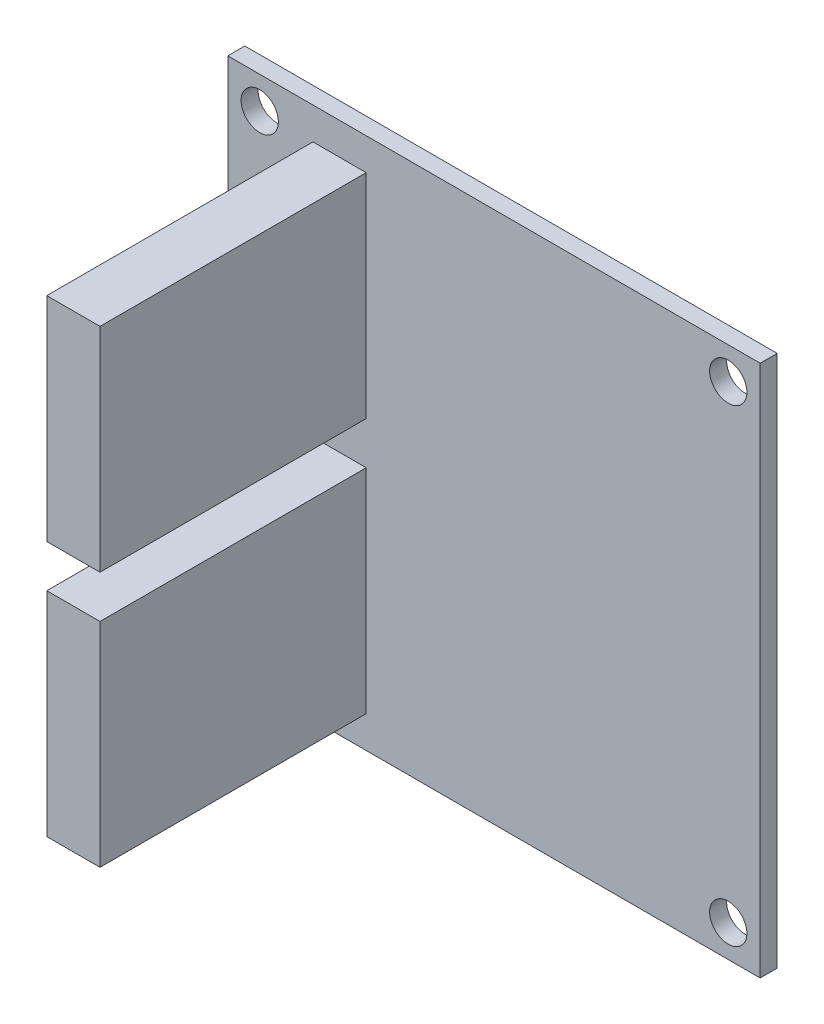
ISO-10303-21;
HEADER;
FILE_DESCRIPTION(('STEP AP214'),'2;1');
FILE_NAME('part.step','',(''),(''),'','','');
FILE_SCHEMA(('AUTOMOTIVE_DESIGN { 1 0 10303 214 1 1 1 1 }'));
ENDSEC;
DATA;
#1=APPLICATION_CONTEXT('core data for automotive mechanical design processes');
#2=APPLICATION_PROTOCOL_DEFINITION('international standard','automotive_design',2000,#1);
#3=PRODUCT_CONTEXT('',#1,'mechanical');
#4=PRODUCT('Part','Part','',(#3));
#5=PRODUCT_RELATED_PRODUCT_CATEGORY('part','',(#4));
#6=PRODUCT_DEFINITION_FORMATION('','',#4);
#7=PRODUCT_DEFINITION_CONTEXT('part definition',#1,'design');
#8=PRODUCT_DEFINITION('design','',#6,#7);
#9=PRODUCT_DEFINITION_SHAPE('','',#8);
#10=(LENGTH_UNIT() NAMED_UNIT(*) SI_UNIT(.MILLI.,.METRE.));
#11=(NAMED_UNIT(*) PLANE_ANGLE_UNIT() SI_UNIT($,.RADIAN.));
#12=(NAMED_UNIT(*) SI_UNIT($,.STERADIAN.) SOLID_ANGLE_UNIT());
#13=UNCERTAINTY_MEASURE_WITH_UNIT(LENGTH_MEASURE(1.E-05),#10,'distance_accuracy_value','');
#14=(GEOMETRIC_REPRESENTATION_CONTEXT(3) GLOBAL_UNCERTAINTY_ASSIGNED_CONTEXT((#13)) GLOBAL_UNIT_ASSIGNED_CONTEXT((#10,
#11,#12)) REPRESENTATION_CONTEXT('',''));
#15=CARTESIAN_POINT('',(0.,0.,0.));
#16=DIRECTION('',(0.,0.,1.));
#17=DIRECTION('',(1.,0.,0.));
#18=AXIS2_PLACEMENT_3D('',#15,#16,#17);
#19=CARTESIAN_POINT('',(0.,0.,1.6));
#20=DIRECTION('',(0.,0.,-1.));
#21=DIRECTION('',(-1.,0.,0.));
#22=AXIS2_PLACEMENT_3D('',#19,#20,#21);
#23=PLANE('',#22);
#24=DIRECTION('',(0.,-1.,0.));
#25=VECTOR('',#24,1.);
#26=CARTESIAN_POINT('',(8.,47.,1.6));
#27=LINE('',#26,#25);
#28=CARTESIAN_POINT('',(8.,47.,1.6));
#29=VERTEX_POINT('',#28);
#30=CARTESIAN_POINT('',(8.,27.,1.6));
#31=VERTEX_POINT('',#30);
#32=EDGE_CURVE('E142',#29,#31,#27,.T.);
#33=ORIENTED_EDGE('',*,*,#32,.F.);
#34=DIRECTION('',(-1.,0.,0.));
#35=VECTOR('',#34,1.);
#36=CARTESIAN_POINT('',(8.,47.,1.6));
#37=LINE('',#36,#35);
#38=CARTESIAN_POINT('',(13.,47.,1.6));
#39=VERTEX_POINT('',#38);
#40=EDGE_CURVE('E155',#39,#29,#37,.T.);
#41=ORIENTED_EDGE('',*,*,#40,.F.);
#42=DIRECTION('',(0.,1.,0.));
#43=VECTOR('',#42,1.);
#44=CARTESIAN_POINT('',(13.,47.,1.6));
#45=LINE('',#44,#43);
#46=CARTESIAN_POINT('',(13.,27.,1.6));
#47=VERTEX_POINT('',#46);
#48=EDGE_CURVE('E164',#47,#39,#45,.T.);
#49=ORIENTED_EDGE('',*,*,#48,.F.);
#50=DIRECTION('',(1.,0.,0.));
#51=VECTOR('',#50,1.);
#52=CARTESIAN_POINT('',(8.,27.,1.6));
#53=LINE('',#52,#51);
#54=EDGE_CURVE('E145',#31,#47,#53,.T.);
#55=ORIENTED_EDGE('',*,*,#54,.F.);
#56=EDGE_LOOP('',(#33,#41,#49,#55));
#57=FACE_BOUND('',#56,.T.);
#58=CARTESIAN_POINT('',(47.,3.,1.6));
#59=DIRECTION('',(0.,0.,-1.));
#60=DIRECTION('',(-1.,0.,0.));
#61=AXIS2_PLACEMENT_3D('',#58,#59,#60);
#62=CIRCLE('',#61,1.75);
#63=CARTESIAN_POINT('',(45.25,3.,1.6));
#64=VERTEX_POINT('',#63);
#65=EDGE_CURVE('E195',#64,#64,#62,.T.);
#66=ORIENTED_EDGE('',*,*,#65,.T.);
#67=EDGE_LOOP('',(#66));
#68=FACE_BOUND('',#67,.T.);
#69=CARTESIAN_POINT('',(47.,47.,1.6));
#70=DIRECTION('',(0.,0.,-1.));
#71=DIRECTION('',(-1.,0.,0.));
#72=AXIS2_PLACEMENT_3D('',#69,#70,#71);
#73=CIRCLE('',#72,1.75);
#74=CARTESIAN_POINT('',(45.25,47.,1.6));
#75=VERTEX_POINT('',#74);
#76=EDGE_CURVE('E192',#75,#75,#73,.T.);
#77=ORIENTED_EDGE('',*,*,#76,.T.);
#78=EDGE_LOOP('',(#77));
#79=FACE_BOUND('',#78,.T.);
#80=CARTESIAN_POINT('',(3.,47.,1.6));
#81=DIRECTION('',(0.,0.,-1.));
#82=DIRECTION('',(-1.,0.,0.));
#83=AXIS2_PLACEMENT_3D('',#80,#81,#82);
#84=CIRCLE('',#83,1.75);
#85=CARTESIAN_POINT('',(1.25,47.,1.6));
#86=VERTEX_POINT('',#85);
#87=EDGE_CURVE('E184',#86,#86,#84,.T.);
#88=ORIENTED_EDGE('',*,*,#87,.T.);
#89=EDGE_LOOP('',(#88));
#90=FACE_BOUND('',#89,.T.);
#91=CARTESIAN_POINT('',(3.00000000000001,3.,1.6));
#92=DIRECTION('',(0.,0.,-1.));
#93=DIRECTION('',(-1.,0.,0.));
#94=AXIS2_PLACEMENT_3D('',#91,#92,#93);
#95=CIRCLE('',#94,1.75);
#96=CARTESIAN_POINT('',(1.25000000000001,3.,1.6));
#97=VERTEX_POINT('',#96);
#98=EDGE_CURVE('E201',#97,#97,#95,.T.);
#99=ORIENTED_EDGE('',*,*,#98,.T.);
#100=EDGE_LOOP('',(#99));
#101=FACE_BOUND('',#100,.T.);
#102=DIRECTION('',(0.,-1.,0.));
#103=VECTOR('',#102,1.);
#104=CARTESIAN_POINT('',(0.,0.,1.6));
#105=LINE('',#104,#103);
#106=CARTESIAN_POINT('',(0.,50.,1.6));
#107=VERTEX_POINT('',#106);
#108=CARTESIAN_POINT('',(0.,0.,1.6));
#109=VERTEX_POINT('',#108);
#110=EDGE_CURVE('E205',#107,#109,#105,.T.);
#111=ORIENTED_EDGE('',*,*,#110,.T.);
#112=DIRECTION('',(1.,0.,0.));
#113=VECTOR('',#112,1.);
#114=CARTESIAN_POINT('',(0.,0.,1.6));
#115=LINE('',#114,#113);
#116=CARTESIAN_POINT('',(50.,0.,1.6));
#117=VERTEX_POINT('',#116);
#118=EDGE_CURVE('E208',#109,#117,#115,.T.);
#119=ORIENTED_EDGE('',*,*,#118,.T.);
#120=DIRECTION('',(0.,1.,0.));
#121=VECTOR('',#120,1.);
#122=CARTESIAN_POINT('',(50.,0.,1.6));
#123=LINE('',#122,#121);
#124=CARTESIAN_POINT('',(50.,50.,1.6));
#125=VERTEX_POINT('',#124);
#126=EDGE_CURVE('E211',#117,#125,#123,.T.);
#127=ORIENTED_EDGE('',*,*,#126,.T.);
#128=DIRECTION('',(-1.,0.,0.));
#129=VECTOR('',#128,1.);
#130=CARTESIAN_POINT('',(0.,50.,1.6));
#131=LINE('',#130,#129);
#132=EDGE_CURVE('E213',#125,#107,#131,.T.);
#133=ORIENTED_EDGE('',*,*,#132,.T.);
#134=EDGE_LOOP('',(#111,#119,#127,#133));
#135=FACE_BOUND('',#134,.T.);
#136=DIRECTION('',(1.,0.,0.));
#137=VECTOR('',#136,1.);
#138=CARTESIAN_POINT('',(8.,3.,1.6));
#139=LINE('',#138,#137);
#140=CARTESIAN_POINT('',(8.,3.,1.6));
#141=VERTEX_POINT('',#140);
#142=CARTESIAN_POINT('',(13.,3.,1.6));
#143=VERTEX_POINT('',#142);
#144=EDGE_CURVE('E141',#141,#143,#139,.T.);
#145=ORIENTED_EDGE('',*,*,#144,.F.);
#146=DIRECTION('',(0.,-1.,0.));
#147=VECTOR('',#146,1.);
#148=CARTESIAN_POINT('',(8.,3.,1.6));
#149=LINE('',#148,#147);
#150=CARTESIAN_POINT('',(8.,23.,1.6));
#151=VERTEX_POINT('',#150);
#152=EDGE_CURVE('E138',#151,#141,#149,.T.);
#153=ORIENTED_EDGE('',*,*,#152,.F.);
#154=DIRECTION('',(-1.,0.,0.));
#155=VECTOR('',#154,1.);
#156=CARTESIAN_POINT('',(8.,23.,1.6));
#157=LINE('',#156,#155);
#158=CARTESIAN_POINT('',(13.,23.,1.6));
#159=VERTEX_POINT('',#158);
#160=EDGE_CURVE('E52',#159,#151,#157,.T.);
#161=ORIENTED_EDGE('',*,*,#160,.F.);
#162=DIRECTION('',(0.,1.,0.));
#163=VECTOR('',#162,1.);
#164=CARTESIAN_POINT('',(13.,3.,1.6));
#165=LINE('',#164,#163);
#166=EDGE_CURVE('E47',#143,#159,#165,.T.);
#167=ORIENTED_EDGE('',*,*,#166,.F.);
#168=EDGE_LOOP('',(#145,#153,#161,#167));
#169=FACE_BOUND('',#168,.T.);
#170=ADVANCED_FACE('F32',(#57,#68,#79,#90,#101,#135,#169),#23,.F.);
#171=CARTESIAN_POINT('',(0.,0.,1.6));
#172=DIRECTION('',(1.,0.,0.));
#173=DIRECTION('',(0.,0.,-1.));
#174=AXIS2_PLACEMENT_3D('',#171,#172,#173);
#175=PLANE('',#174);
#176=DIRECTION('',(0.,-1.,0.));
#177=VECTOR('',#176,1.);
#178=CARTESIAN_POINT('',(0.,0.,0.));
#179=LINE('',#178,#177);
#180=CARTESIAN_POINT('',(0.,50.,0.));
#181=VERTEX_POINT('',#180);
#182=CARTESIAN_POINT('',(0.,0.,0.));
#183=VERTEX_POINT('',#182);
#184=EDGE_CURVE('E204',#181,#183,#179,.T.);
#185=ORIENTED_EDGE('',*,*,#184,.T.);
#186=DIRECTION('',(0.,0.,-1.));
#187=VECTOR('',#186,1.);
#188=CARTESIAN_POINT('',(0.,0.,1.6));
#189=LINE('',#188,#187);
#190=EDGE_CURVE('E11',#109,#183,#189,.T.);
#191=ORIENTED_EDGE('',*,*,#190,.F.);
#192=ORIENTED_EDGE('',*,*,#110,.F.);
#193=DIRECTION('',(0.,0.,-1.));
#194=VECTOR('',#193,1.);
#195=CARTESIAN_POINT('',(0.,50.,1.6));
#196=LINE('',#195,#194);
#197=EDGE_CURVE('E215',#107,#181,#196,.T.);
#198=ORIENTED_EDGE('',*,*,#197,.T.);
#199=EDGE_LOOP('',(#185,#191,#192,#198));
#200=FACE_BOUND('',#199,.T.);
#201=ADVANCED_FACE('F34',(#200),#175,.F.);
#202=CARTESIAN_POINT('',(0.,0.,1.6));
#203=DIRECTION('',(0.,1.,0.));
#204=DIRECTION('',(0.,0.,1.));
#205=AXIS2_PLACEMENT_3D('',#202,#203,#204);
#206=PLANE('',#205);
#207=DIRECTION('',(1.,0.,0.));
#208=VECTOR('',#207,1.);
#209=CARTESIAN_POINT('',(0.,0.,0.));
#210=LINE('',#209,#208);
#211=CARTESIAN_POINT('',(50.,0.,0.));
#212=VERTEX_POINT('',#211);
#213=EDGE_CURVE('E218',#183,#212,#210,.T.);
#214=ORIENTED_EDGE('',*,*,#213,.T.);
#215=DIRECTION('',(0.,0.,-1.));
#216=VECTOR('',#215,1.);
#217=CARTESIAN_POINT('',(50.,0.,1.6));
#218=LINE('',#217,#216);
#219=EDGE_CURVE('E40',#117,#212,#218,.T.);
#220=ORIENTED_EDGE('',*,*,#219,.F.);
#221=ORIENTED_EDGE('',*,*,#118,.F.);
#222=ORIENTED_EDGE('',*,*,#190,.T.);
#223=EDGE_LOOP('',(#214,#220,#221,#222));
#224=FACE_BOUND('',#223,.T.);
#225=ADVANCED_FACE('F247',(#224),#206,.F.);
#226=CARTESIAN_POINT('',(50.,0.,1.6));
#227=DIRECTION('',(-1.,0.,0.));
#228=DIRECTION('',(0.,0.,1.));
#229=AXIS2_PLACEMENT_3D('',#226,#227,#228);
#230=PLANE('',#229);
#231=DIRECTION('',(0.,1.,0.));
#232=VECTOR('',#231,1.);
#233=CARTESIAN_POINT('',(50.,0.,0.));
#234=LINE('',#233,#232);
#235=CARTESIAN_POINT('',(50.,50.,0.));
#236=VERTEX_POINT('',#235);
#237=EDGE_CURVE('E220',#212,#236,#234,.T.);
#238=ORIENTED_EDGE('',*,*,#237,.T.);
#239=DIRECTION('',(0.,0.,-1.));
#240=VECTOR('',#239,1.);
#241=CARTESIAN_POINT('',(50.,50.,1.6));
#242=LINE('',#241,#240);
#243=EDGE_CURVE('E225',#125,#236,#242,.T.);
#244=ORIENTED_EDGE('',*,*,#243,.F.);
#245=ORIENTED_EDGE('',*,*,#126,.F.);
#246=ORIENTED_EDGE('',*,*,#219,.T.);
#247=EDGE_LOOP('',(#238,#244,#245,#246));
#248=FACE_BOUND('',#247,.T.);
#249=ADVANCED_FACE('F232',(#248),#230,.F.);
#250=CARTESIAN_POINT('',(0.,50.,1.6));
#251=DIRECTION('',(0.,-1.,0.));
#252=DIRECTION('',(0.,0.,-1.));
#253=AXIS2_PLACEMENT_3D('',#250,#251,#252);
#254=PLANE('',#253);
#255=DIRECTION('',(-1.,0.,0.));
#256=VECTOR('',#255,1.);
#257=CARTESIAN_POINT('',(0.,50.,0.));
#258=LINE('',#257,#256);
#259=EDGE_CURVE('E209',#236,#181,#258,.T.);
#260=ORIENTED_EDGE('',*,*,#259,.T.);
#261=ORIENTED_EDGE('',*,*,#197,.F.);
#262=ORIENTED_EDGE('',*,*,#132,.F.);
#263=ORIENTED_EDGE('',*,*,#243,.T.);
#264=EDGE_LOOP('',(#260,#261,#262,#263));
#265=FACE_BOUND('',#264,.T.);
#266=ADVANCED_FACE('F241',(#265),#254,.F.);
#267=CARTESIAN_POINT('',(0.,0.,0.));
#268=DIRECTION('',(0.,0.,-1.));
#269=DIRECTION('',(-1.,0.,0.));
#270=AXIS2_PLACEMENT_3D('',#267,#268,#269);
#271=PLANE('',#270);
#272=CARTESIAN_POINT('',(47.,3.,0.));
#273=DIRECTION('',(0.,0.,1.));
#274=DIRECTION('',(-1.,0.,0.));
#275=AXIS2_PLACEMENT_3D('',#272,#273,#274);
#276=CIRCLE('',#275,1.75);
#277=CARTESIAN_POINT('',(45.25,3.,0.));
#278=VERTEX_POINT('',#277);
#279=EDGE_CURVE('E181',#278,#278,#276,.T.);
#280=ORIENTED_EDGE('',*,*,#279,.T.);
#281=EDGE_LOOP('',(#280));
#282=FACE_BOUND('',#281,.T.);
#283=CARTESIAN_POINT('',(47.,47.,0.));
#284=DIRECTION('',(0.,0.,1.));
#285=DIRECTION('',(1.,0.,0.));
#286=AXIS2_PLACEMENT_3D('',#283,#284,#285);
#287=CIRCLE('',#286,1.75);
#288=CARTESIAN_POINT('',(48.75,47.,0.));
#289=VERTEX_POINT('',#288);
#290=EDGE_CURVE('E185',#289,#289,#287,.T.);
#291=ORIENTED_EDGE('',*,*,#290,.T.);
#292=EDGE_LOOP('',(#291));
#293=FACE_BOUND('',#292,.T.);
#294=CARTESIAN_POINT('',(3.,47.,0.));
#295=DIRECTION('',(0.,0.,1.));
#296=DIRECTION('',(-1.,0.,0.));
#297=AXIS2_PLACEMENT_3D('',#294,#295,#296);
#298=CIRCLE('',#297,1.75);
#299=CARTESIAN_POINT('',(1.25,47.,0.));
#300=VERTEX_POINT('',#299);
#301=EDGE_CURVE('E180',#300,#300,#298,.T.);
#302=ORIENTED_EDGE('',*,*,#301,.T.);
#303=EDGE_LOOP('',(#302));
#304=FACE_BOUND('',#303,.T.);
#305=CARTESIAN_POINT('',(3.00000000000001,3.,0.));
#306=DIRECTION('',(0.,0.,1.));
#307=DIRECTION('',(1.,0.,0.));
#308=AXIS2_PLACEMENT_3D('',#305,#306,#307);
#309=CIRCLE('',#308,1.75);
#310=CARTESIAN_POINT('',(4.75000000000001,3.,0.));
#311=VERTEX_POINT('',#310);
#312=EDGE_CURVE('E198',#311,#311,#309,.T.);
#313=ORIENTED_EDGE('',*,*,#312,.T.);
#314=EDGE_LOOP('',(#313));
#315=FACE_BOUND('',#314,.T.);
#316=ORIENTED_EDGE('',*,*,#184,.F.);
#317=ORIENTED_EDGE('',*,*,#259,.F.);
#318=ORIENTED_EDGE('',*,*,#237,.F.);
#319=ORIENTED_EDGE('',*,*,#213,.F.);
#320=EDGE_LOOP('',(#316,#317,#318,#319));
#321=FACE_BOUND('',#320,.T.);
#322=ADVANCED_FACE('F238',(#282,#293,#304,#315,#321),#271,.T.);
#323=CARTESIAN_POINT('',(3.00000000000001,3.,0.));
#324=DIRECTION('',(0.,0.,1.));
#325=DIRECTION('',(1.,0.,0.));
#326=AXIS2_PLACEMENT_3D('',#323,#324,#325);
#327=CYLINDRICAL_SURFACE('',#326,1.75);
#328=ORIENTED_EDGE('',*,*,#312,.F.);
#329=EDGE_LOOP('',(#328));
#330=FACE_BOUND('',#329,.T.);
#331=ORIENTED_EDGE('',*,*,#98,.F.);
#332=EDGE_LOOP('',(#331));
#333=FACE_BOUND('',#332,.T.);
#334=ADVANCED_FACE('F264',(#330,#333),#327,.F.);
#335=CARTESIAN_POINT('',(3.,47.,0.));
#336=DIRECTION('',(0.,0.,1.));
#337=DIRECTION('',(1.,0.,0.));
#338=AXIS2_PLACEMENT_3D('',#335,#336,#337);
#339=CYLINDRICAL_SURFACE('',#338,1.75);
#340=ORIENTED_EDGE('',*,*,#301,.F.);
#341=EDGE_LOOP('',(#340));
#342=FACE_BOUND('',#341,.T.);
#343=ORIENTED_EDGE('',*,*,#87,.F.);
#344=EDGE_LOOP('',(#343));
#345=FACE_BOUND('',#344,.T.);
#346=ADVANCED_FACE('F284',(#342,#345),#339,.F.);
#347=CARTESIAN_POINT('',(47.,47.,0.));
#348=DIRECTION('',(0.,0.,1.));
#349=DIRECTION('',(1.,0.,0.));
#350=AXIS2_PLACEMENT_3D('',#347,#348,#349);
#351=CYLINDRICAL_SURFACE('',#350,1.75);
#352=ORIENTED_EDGE('',*,*,#290,.F.);
#353=EDGE_LOOP('',(#352));
#354=FACE_BOUND('',#353,.T.);
#355=ORIENTED_EDGE('',*,*,#76,.F.);
#356=EDGE_LOOP('',(#355));
#357=FACE_BOUND('',#356,.T.);
#358=ADVANCED_FACE('F291',(#354,#357),#351,.F.);
#359=CARTESIAN_POINT('',(47.,3.,0.));
#360=DIRECTION('',(0.,0.,1.));
#361=DIRECTION('',(1.,0.,0.));
#362=AXIS2_PLACEMENT_3D('',#359,#360,#361);
#363=CYLINDRICAL_SURFACE('',#362,1.75);
#364=ORIENTED_EDGE('',*,*,#279,.F.);
#365=EDGE_LOOP('',(#364));
#366=FACE_BOUND('',#365,.T.);
#367=ORIENTED_EDGE('',*,*,#65,.F.);
#368=EDGE_LOOP('',(#367));
#369=FACE_BOUND('',#368,.T.);
#370=ADVANCED_FACE('F298',(#366,#369),#363,.F.);
#371=CARTESIAN_POINT('',(8.,47.,26.6));
#372=DIRECTION('',(1.,0.,0.));
#373=DIRECTION('',(0.,1.,0.));
#374=AXIS2_PLACEMENT_3D('',#371,#372,#373);
#375=PLANE('',#374);
#376=ORIENTED_EDGE('',*,*,#32,.T.);
#377=DIRECTION('',(0.,0.,-1.));
#378=VECTOR('',#377,1.);
#379=CARTESIAN_POINT('',(8.,27.,26.6));
#380=LINE('',#379,#378);
#381=CARTESIAN_POINT('',(8.,27.,26.6));
#382=VERTEX_POINT('',#381);
#383=EDGE_CURVE('E177',#382,#31,#380,.T.);
#384=ORIENTED_EDGE('',*,*,#383,.F.);
#385=DIRECTION('',(0.,-1.,0.));
#386=VECTOR('',#385,1.);
#387=CARTESIAN_POINT('',(8.,47.,26.6));
#388=LINE('',#387,#386);
#389=CARTESIAN_POINT('',(8.,47.,26.6));
#390=VERTEX_POINT('',#389);
#391=EDGE_CURVE('E151',#390,#382,#388,.T.);
#392=ORIENTED_EDGE('',*,*,#391,.F.);
#393=DIRECTION('',(0.,0.,-1.));
#394=VECTOR('',#393,1.);
#395=CARTESIAN_POINT('',(8.,47.,26.6));
#396=LINE('',#395,#394);
#397=EDGE_CURVE('E160',#390,#29,#396,.T.);
#398=ORIENTED_EDGE('',*,*,#397,.T.);
#399=EDGE_LOOP('',(#376,#384,#392,#398));
#400=FACE_BOUND('',#399,.T.);
#401=ADVANCED_FACE('F304',(#400),#375,.F.);
#402=CARTESIAN_POINT('',(8.,27.,26.6));
#403=DIRECTION('',(0.,1.,0.));
#404=DIRECTION('',(0.,0.,1.));
#405=AXIS2_PLACEMENT_3D('',#402,#403,#404);
#406=PLANE('',#405);
#407=ORIENTED_EDGE('',*,*,#54,.T.);
#408=DIRECTION('',(0.,0.,-1.));
#409=VECTOR('',#408,1.);
#410=CARTESIAN_POINT('',(13.,27.,26.6));
#411=LINE('',#410,#409);
#412=CARTESIAN_POINT('',(13.,27.,26.6));
#413=VERTEX_POINT('',#412);
#414=EDGE_CURVE('E174',#413,#47,#411,.T.);
#415=ORIENTED_EDGE('',*,*,#414,.F.);
#416=DIRECTION('',(1.,0.,0.));
#417=VECTOR('',#416,1.);
#418=CARTESIAN_POINT('',(8.,27.,26.6));
#419=LINE('',#418,#417);
#420=EDGE_CURVE('E154',#382,#413,#419,.T.);
#421=ORIENTED_EDGE('',*,*,#420,.F.);
#422=ORIENTED_EDGE('',*,*,#383,.T.);
#423=EDGE_LOOP('',(#407,#415,#421,#422));
#424=FACE_BOUND('',#423,.T.);
#425=ADVANCED_FACE('F317',(#424),#406,.F.);
#426=CARTESIAN_POINT('',(13.,47.,26.6));
#427=DIRECTION('',(-1.,0.,0.));
#428=DIRECTION('',(0.,-1.,0.));
#429=AXIS2_PLACEMENT_3D('',#426,#427,#428);
#430=PLANE('',#429);
#431=ORIENTED_EDGE('',*,*,#48,.T.);
#432=DIRECTION('',(0.,0.,-1.));
#433=VECTOR('',#432,1.);
#434=CARTESIAN_POINT('',(13.,47.,26.6));
#435=LINE('',#434,#433);
#436=CARTESIAN_POINT('',(13.,47.,26.6));
#437=VERTEX_POINT('',#436);
#438=EDGE_CURVE('E171',#437,#39,#435,.T.);
#439=ORIENTED_EDGE('',*,*,#438,.F.);
#440=DIRECTION('',(0.,1.,0.));
#441=VECTOR('',#440,1.);
#442=CARTESIAN_POINT('',(13.,47.,26.6));
#443=LINE('',#442,#441);
#444=EDGE_CURVE('E157',#413,#437,#443,.T.);
#445=ORIENTED_EDGE('',*,*,#444,.F.);
#446=ORIENTED_EDGE('',*,*,#414,.T.);
#447=EDGE_LOOP('',(#431,#439,#445,#446));
#448=FACE_BOUND('',#447,.T.);
#449=ADVANCED_FACE('F324',(#448),#430,.F.);
#450=CARTESIAN_POINT('',(8.,47.,26.6));
#451=DIRECTION('',(0.,-1.,0.));
#452=DIRECTION('',(1.,0.,0.));
#453=AXIS2_PLACEMENT_3D('',#450,#451,#452);
#454=PLANE('',#453);
#455=ORIENTED_EDGE('',*,*,#40,.T.);
#456=ORIENTED_EDGE('',*,*,#397,.F.);
#457=DIRECTION('',(-1.,0.,0.));
#458=VECTOR('',#457,1.);
#459=CARTESIAN_POINT('',(8.,47.,26.6));
#460=LINE('',#459,#458);
#461=EDGE_CURVE('E159',#437,#390,#460,.T.);
#462=ORIENTED_EDGE('',*,*,#461,.F.);
#463=ORIENTED_EDGE('',*,*,#438,.T.);
#464=EDGE_LOOP('',(#455,#456,#462,#463));
#465=FACE_BOUND('',#464,.T.);
#466=ADVANCED_FACE('F332',(#465),#454,.F.);
#467=CARTESIAN_POINT('',(0.,0.,26.6));
#468=DIRECTION('',(0.,0.,1.));
#469=DIRECTION('',(1.,0.,0.));
#470=AXIS2_PLACEMENT_3D('',#467,#468,#469);
#471=PLANE('',#470);
#472=ORIENTED_EDGE('',*,*,#391,.T.);
#473=ORIENTED_EDGE('',*,*,#420,.T.);
#474=ORIENTED_EDGE('',*,*,#444,.T.);
#475=ORIENTED_EDGE('',*,*,#461,.T.);
#476=EDGE_LOOP('',(#472,#473,#474,#475));
#477=FACE_BOUND('',#476,.T.);
#478=ADVANCED_FACE('F340',(#477),#471,.T.);
#479=CARTESIAN_POINT('',(8.,3.,26.6));
#480=DIRECTION('',(0.,1.,0.));
#481=DIRECTION('',(-1.,0.,0.));
#482=AXIS2_PLACEMENT_3D('',#479,#480,#481);
#483=PLANE('',#482);
#484=ORIENTED_EDGE('',*,*,#144,.T.);
#485=DIRECTION('',(0.,0.,-1.));
#486=VECTOR('',#485,1.);
#487=CARTESIAN_POINT('',(13.,3.,26.6));
#488=LINE('',#487,#486);
#489=CARTESIAN_POINT('',(13.,3.,26.6));
#490=VERTEX_POINT('',#489);
#491=EDGE_CURVE('E122',#490,#143,#488,.T.);
#492=ORIENTED_EDGE('',*,*,#491,.F.);
#493=DIRECTION('',(1.,0.,0.));
#494=VECTOR('',#493,1.);
#495=CARTESIAN_POINT('',(8.,3.,26.6));
#496=LINE('',#495,#494);
#497=CARTESIAN_POINT('',(8.,3.,26.6));
#498=VERTEX_POINT('',#497);
#499=EDGE_CURVE('E129',#498,#490,#496,.T.);
#500=ORIENTED_EDGE('',*,*,#499,.F.);
#501=DIRECTION('',(0.,0.,-1.));
#502=VECTOR('',#501,1.);
#503=CARTESIAN_POINT('',(8.,3.,26.6));
#504=LINE('',#503,#502);
#505=EDGE_CURVE('E407',#498,#141,#504,.T.);
#506=ORIENTED_EDGE('',*,*,#505,.T.);
#507=EDGE_LOOP('',(#484,#492,#500,#506));
#508=FACE_BOUND('',#507,.T.);
#509=ADVANCED_FACE('F140',(#508),#483,.F.);
#510=CARTESIAN_POINT('',(13.,3.,26.6));
#511=DIRECTION('',(-1.,0.,0.));
#512=DIRECTION('',(0.,-1.,0.));
#513=AXIS2_PLACEMENT_3D('',#510,#511,#512);
#514=PLANE('',#513);
#515=ORIENTED_EDGE('',*,*,#166,.T.);
#516=DIRECTION('',(0.,0.,-1.));
#517=VECTOR('',#516,1.);
#518=CARTESIAN_POINT('',(13.,23.,26.6));
#519=LINE('',#518,#517);
#520=CARTESIAN_POINT('',(13.,23.,26.6));
#521=VERTEX_POINT('',#520);
#522=EDGE_CURVE('E125',#521,#159,#519,.T.);
#523=ORIENTED_EDGE('',*,*,#522,.F.);
#524=DIRECTION('',(0.,1.,0.));
#525=VECTOR('',#524,1.);
#526=CARTESIAN_POINT('',(13.,3.,26.6));
#527=LINE('',#526,#525);
#528=EDGE_CURVE('E118',#490,#521,#527,.T.);
#529=ORIENTED_EDGE('',*,*,#528,.F.);
#530=ORIENTED_EDGE('',*,*,#491,.T.);
#531=EDGE_LOOP('',(#515,#523,#529,#530));
#532=FACE_BOUND('',#531,.T.);
#533=ADVANCED_FACE('F120',(#532),#514,.F.);
#534=CARTESIAN_POINT('',(8.,23.,26.6));
#535=DIRECTION('',(0.,-1.,0.));
#536=DIRECTION('',(0.,0.,-1.));
#537=AXIS2_PLACEMENT_3D('',#534,#535,#536);
#538=PLANE('',#537);
#539=ORIENTED_EDGE('',*,*,#160,.T.);
#540=DIRECTION('',(0.,0.,-1.));
#541=VECTOR('',#540,1.);
#542=CARTESIAN_POINT('',(8.,23.,26.6));
#543=LINE('',#542,#541);
#544=CARTESIAN_POINT('',(8.,23.,26.6));
#545=VERTEX_POINT('',#544);
#546=EDGE_CURVE('E147',#545,#151,#543,.T.);
#547=ORIENTED_EDGE('',*,*,#546,.F.);
#548=DIRECTION('',(-1.,0.,0.));
#549=VECTOR('',#548,1.);
#550=CARTESIAN_POINT('',(8.,23.,26.6));
#551=LINE('',#550,#549);
#552=EDGE_CURVE('E128',#521,#545,#551,.T.);
#553=ORIENTED_EDGE('',*,*,#552,.F.);
#554=ORIENTED_EDGE('',*,*,#522,.T.);
#555=EDGE_LOOP('',(#539,#547,#553,#554));
#556=FACE_BOUND('',#555,.T.);
#557=ADVANCED_FACE('F361',(#556),#538,.F.);
#558=CARTESIAN_POINT('',(8.,3.,26.6));
#559=DIRECTION('',(1.,0.,0.));
#560=DIRECTION('',(0.,1.,0.));
#561=AXIS2_PLACEMENT_3D('',#558,#559,#560);
#562=PLANE('',#561);
#563=ORIENTED_EDGE('',*,*,#152,.T.);
#564=ORIENTED_EDGE('',*,*,#505,.F.);
#565=DIRECTION('',(0.,-1.,0.));
#566=VECTOR('',#565,1.);
#567=CARTESIAN_POINT('',(8.,3.,26.6));
#568=LINE('',#567,#566);
#569=EDGE_CURVE('E134',#545,#498,#568,.T.);
#570=ORIENTED_EDGE('',*,*,#569,.F.);
#571=ORIENTED_EDGE('',*,*,#546,.T.);
#572=EDGE_LOOP('',(#563,#564,#570,#571));
#573=FACE_BOUND('',#572,.T.);
#574=ADVANCED_FACE('F368',(#573),#562,.F.);
#575=CARTESIAN_POINT('',(0.,0.,26.6));
#576=DIRECTION('',(0.,0.,1.));
#577=DIRECTION('',(1.,0.,0.));
#578=AXIS2_PLACEMENT_3D('',#575,#576,#577);
#579=PLANE('',#578);
#580=ORIENTED_EDGE('',*,*,#499,.T.);
#581=ORIENTED_EDGE('',*,*,#528,.T.);
#582=ORIENTED_EDGE('',*,*,#552,.T.);
#583=ORIENTED_EDGE('',*,*,#569,.T.);
#584=EDGE_LOOP('',(#580,#581,#582,#583));
#585=FACE_BOUND('',#584,.T.);
#586=ADVANCED_FACE('F132',(#585),#579,.T.);
#587=CLOSED_SHELL('',(#170,#201,#225,#249,#266,#322,#334,#346,#358,#370,#401,#425,#449,#466,
#478,#509,#533,#557,#574,#586));
#588=MANIFOLD_SOLID_BREP('B2',#587);
#589=ADVANCED_BREP_SHAPE_REPRESENTATION('',(#18,#588),#14);
#590=SHAPE_DEFINITION_REPRESENTATION(#9,#589);
ENDSEC;
END-ISO-10303-21;
